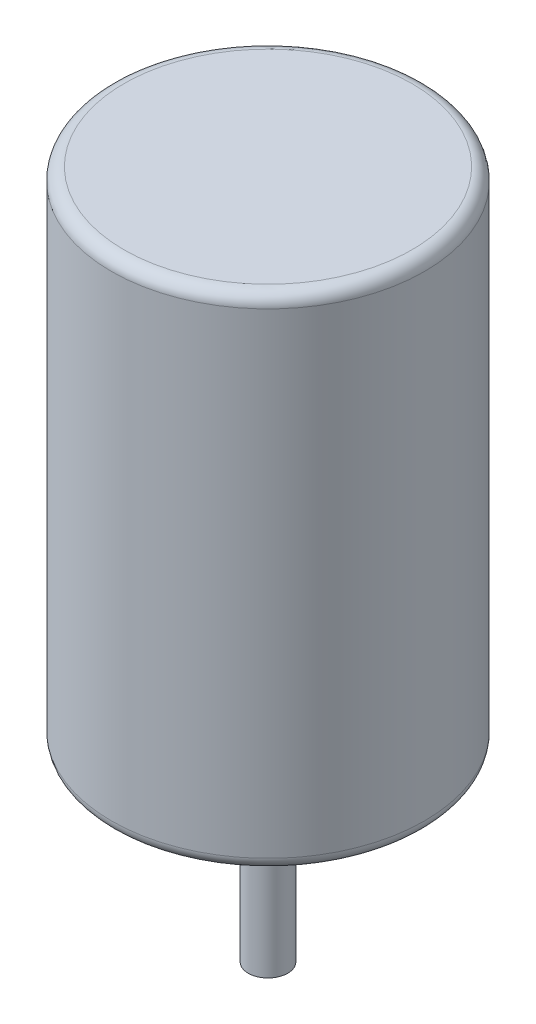
ISO-10303-21;
HEADER;
FILE_DESCRIPTION(('STEP AP214'),'2;1');
FILE_NAME('part.step','',(''),(''),'','','');
FILE_SCHEMA(('AUTOMOTIVE_DESIGN { 1 0 10303 214 1 1 1 1 }'));
ENDSEC;
DATA;
#1=APPLICATION_CONTEXT('core data for automotive mechanical design processes');
#2=APPLICATION_PROTOCOL_DEFINITION('international standard','automotive_design',2000,#1);
#3=PRODUCT_CONTEXT('',#1,'mechanical');
#4=PRODUCT('Part','Part','',(#3));
#5=PRODUCT_RELATED_PRODUCT_CATEGORY('part','',(#4));
#6=PRODUCT_DEFINITION_FORMATION('','',#4);
#7=PRODUCT_DEFINITION_CONTEXT('part definition',#1,'design');
#8=PRODUCT_DEFINITION('design','',#6,#7);
#9=PRODUCT_DEFINITION_SHAPE('','',#8);
#10=(LENGTH_UNIT() NAMED_UNIT(*) SI_UNIT(.MILLI.,.METRE.));
#11=(NAMED_UNIT(*) PLANE_ANGLE_UNIT() SI_UNIT($,.RADIAN.));
#12=(NAMED_UNIT(*) SI_UNIT($,.STERADIAN.) SOLID_ANGLE_UNIT());
#13=UNCERTAINTY_MEASURE_WITH_UNIT(LENGTH_MEASURE(1.E-05),#10,'distance_accuracy_value','');
#14=(GEOMETRIC_REPRESENTATION_CONTEXT(3) GLOBAL_UNCERTAINTY_ASSIGNED_CONTEXT((#13)) GLOBAL_UNIT_ASSIGNED_CONTEXT((#10,
#11,#12)) REPRESENTATION_CONTEXT('',''));
#15=CARTESIAN_POINT('',(0.,0.,0.));
#16=DIRECTION('',(0.,0.,1.));
#17=DIRECTION('',(1.,0.,0.));
#18=AXIS2_PLACEMENT_3D('',#15,#16,#17);
#19=CARTESIAN_POINT('',(0.,-30.,0.));
#20=DIRECTION('',(0.,1.,0.));
#21=DIRECTION('',(0.,0.,1.));
#22=AXIS2_PLACEMENT_3D('',#19,#20,#21);
#23=CYLINDRICAL_SURFACE('',#22,3.15);
#24=CARTESIAN_POINT('',(0.,-30.,0.));
#25=DIRECTION('',(0.,1.,0.));
#26=DIRECTION('',(0.,0.,1.));
#27=AXIS2_PLACEMENT_3D('',#24,#25,#26);
#28=CIRCLE('',#27,3.15);
#29=CARTESIAN_POINT('',(0.,-30.,3.15));
#30=VERTEX_POINT('',#29);
#31=EDGE_CURVE('E11',#30,#30,#28,.T.);
#32=ORIENTED_EDGE('',*,*,#31,.T.);
#33=EDGE_LOOP('',(#32));
#34=FACE_BOUND('',#33,.T.);
#35=CARTESIAN_POINT('',(0.,0.,0.));
#36=DIRECTION('',(0.,1.,0.));
#37=DIRECTION('',(0.,0.,1.));
#38=AXIS2_PLACEMENT_3D('',#35,#36,#37);
#39=CIRCLE('',#38,3.15);
#40=CARTESIAN_POINT('',(0.,0.,3.15));
#41=VERTEX_POINT('',#40);
#42=EDGE_CURVE('E54',#41,#41,#39,.T.);
#43=ORIENTED_EDGE('',*,*,#42,.F.);
#44=EDGE_LOOP('',(#43));
#45=FACE_BOUND('',#44,.T.);
#46=ADVANCED_FACE('F51',(#34,#45),#23,.T.);
#47=CARTESIAN_POINT('',(0.,-30.,0.));
#48=DIRECTION('',(0.,1.,0.));
#49=DIRECTION('',(0.,0.,1.));
#50=AXIS2_PLACEMENT_3D('',#47,#48,#49);
#51=PLANE('',#50);
#52=ORIENTED_EDGE('',*,*,#31,.F.);
#53=EDGE_LOOP('',(#52));
#54=FACE_BOUND('',#53,.T.);
#55=ADVANCED_FACE('F66',(#54),#51,.F.);
#56=CARTESIAN_POINT('',(0.,0.,0.));
#57=DIRECTION('',(0.,1.,0.));
#58=DIRECTION('',(0.,0.,1.));
#59=AXIS2_PLACEMENT_3D('',#56,#57,#58);
#60=PLANE('',#59);
#61=ORIENTED_EDGE('',*,*,#42,.T.);
#62=EDGE_LOOP('',(#61));
#63=FACE_BOUND('',#62,.T.);
#64=ADVANCED_FACE('F63',(#63),#60,.T.);
#65=CLOSED_SHELL('',(#46,#55,#64));
#66=MANIFOLD_SOLID_BREP('B2',#65);
#67=CARTESIAN_POINT('',(0.,80.,0.));
#68=DIRECTION('',(0.,-1.,0.));
#69=DIRECTION('',(0.,0.,-1.));
#70=AXIS2_PLACEMENT_3D('',#67,#68,#69);
#71=CYLINDRICAL_SURFACE('',#70,25.);
#72=CARTESIAN_POINT('',(0.,2.,0.));
#73=DIRECTION('',(0.,1.,0.));
#74=DIRECTION('',(0.,0.,1.));
#75=AXIS2_PLACEMENT_3D('',#72,#73,#74);
#76=CIRCLE('',#75,25.);
#77=CARTESIAN_POINT('',(0.,2.,25.));
#78=VERTEX_POINT('',#77);
#79=EDGE_CURVE('E111',#78,#78,#76,.T.);
#80=ORIENTED_EDGE('',*,*,#79,.T.);
#81=EDGE_LOOP('',(#80));
#82=FACE_BOUND('',#81,.T.);
#83=CARTESIAN_POINT('',(0.,78.,0.));
#84=DIRECTION('',(0.,1.,0.));
#85=DIRECTION('',(0.,0.,1.));
#86=AXIS2_PLACEMENT_3D('',#83,#84,#85);
#87=CIRCLE('',#86,25.);
#88=CARTESIAN_POINT('',(0.,78.,25.));
#89=VERTEX_POINT('',#88);
#90=EDGE_CURVE('E116',#89,#89,#87,.F.);
#91=ORIENTED_EDGE('',*,*,#90,.T.);
#92=EDGE_LOOP('',(#91));
#93=FACE_BOUND('',#92,.T.);
#94=ADVANCED_FACE('F98',(#82,#93),#71,.T.);
#95=CARTESIAN_POINT('',(0.,80.,0.));
#96=DIRECTION('',(0.,1.,0.));
#97=DIRECTION('',(0.,0.,1.));
#98=AXIS2_PLACEMENT_3D('',#95,#96,#97);
#99=PLANE('',#98);
#100=CARTESIAN_POINT('',(0.,80.,0.));
#101=DIRECTION('',(0.,1.,0.));
#102=DIRECTION('',(0.,0.,1.));
#103=AXIS2_PLACEMENT_3D('',#100,#101,#102);
#104=CIRCLE('',#103,23.);
#105=CARTESIAN_POINT('',(0.,80.,23.));
#106=VERTEX_POINT('',#105);
#107=EDGE_CURVE('E50',#106,#106,#104,.T.);
#108=ORIENTED_EDGE('',*,*,#107,.T.);
#109=EDGE_LOOP('',(#108));
#110=FACE_BOUND('',#109,.T.);
#111=ADVANCED_FACE('F133',(#110),#99,.T.);
#112=CARTESIAN_POINT('',(0.,0.,0.));
#113=DIRECTION('',(0.,1.,0.));
#114=DIRECTION('',(0.,0.,1.));
#115=AXIS2_PLACEMENT_3D('',#112,#113,#114);
#116=PLANE('',#115);
#117=CARTESIAN_POINT('',(0.,0.,0.));
#118=DIRECTION('',(0.,1.,0.));
#119=DIRECTION('',(0.,0.,1.));
#120=AXIS2_PLACEMENT_3D('',#117,#118,#119);
#121=CIRCLE('',#120,23.);
#122=CARTESIAN_POINT('',(0.,0.,23.));
#123=VERTEX_POINT('',#122);
#124=EDGE_CURVE('E106',#123,#123,#121,.F.);
#125=ORIENTED_EDGE('',*,*,#124,.T.);
#126=EDGE_LOOP('',(#125));
#127=FACE_BOUND('',#126,.T.);
#128=ADVANCED_FACE('F130',(#127),#116,.F.);
#129=CARTESIAN_POINT('',(0.,2.,0.));
#130=DIRECTION('',(0.,1.,0.));
#131=DIRECTION('',(0.,0.,1.));
#132=AXIS2_PLACEMENT_3D('',#129,#130,#131);
#133=TOROIDAL_SURFACE('',#132,23.,2.);
#134=ORIENTED_EDGE('',*,*,#124,.F.);
#135=EDGE_LOOP('',(#134));
#136=FACE_BOUND('',#135,.T.);
#137=ORIENTED_EDGE('',*,*,#79,.F.);
#138=EDGE_LOOP('',(#137));
#139=FACE_BOUND('',#138,.T.);
#140=ADVANCED_FACE('F126',(#136,#139),#133,.T.);
#141=CARTESIAN_POINT('',(0.,78.,0.));
#142=DIRECTION('',(0.,1.,0.));
#143=DIRECTION('',(0.,0.,1.));
#144=AXIS2_PLACEMENT_3D('',#141,#142,#143);
#145=TOROIDAL_SURFACE('',#144,23.,2.);
#146=ORIENTED_EDGE('',*,*,#90,.F.);
#147=EDGE_LOOP('',(#146));
#148=FACE_BOUND('',#147,.T.);
#149=ORIENTED_EDGE('',*,*,#107,.F.);
#150=EDGE_LOOP('',(#149));
#151=FACE_BOUND('',#150,.T.);
#152=ADVANCED_FACE('F100',(#148,#151),#145,.T.);
#153=CLOSED_SHELL('',(#94,#111,#128,#140,#152));
#154=MANIFOLD_SOLID_BREP('B6',#153);
#155=ADVANCED_BREP_SHAPE_REPRESENTATION('',(#18,#66,#154),#14);
#156=SHAPE_DEFINITION_REPRESENTATION(#9,#155);
ENDSEC;
END-ISO-10303-21;
